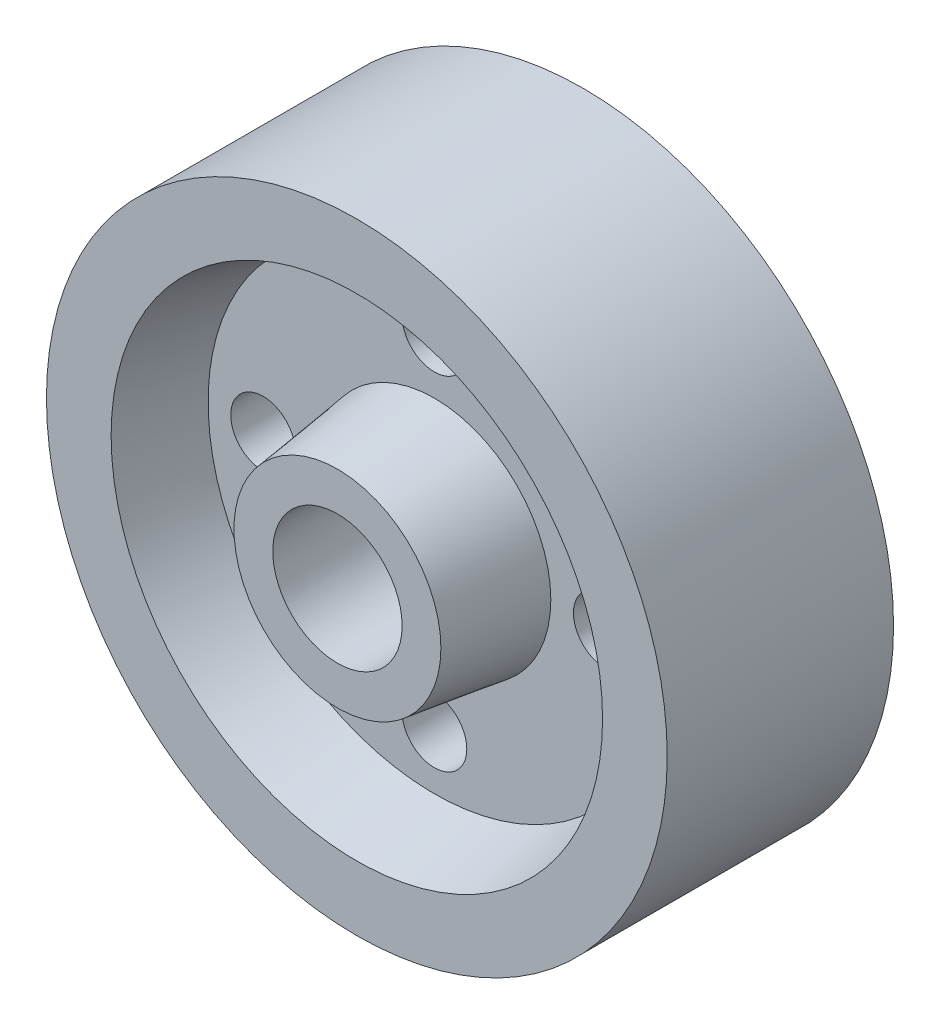
ISO-10303-21;
HEADER;
FILE_DESCRIPTION(('STEP AP214'),'2;1');
FILE_NAME('part.step','',(''),(''),'','','');
FILE_SCHEMA(('AUTOMOTIVE_DESIGN { 1 0 10303 214 1 1 1 1 }'));
ENDSEC;
DATA;
#1=APPLICATION_CONTEXT('core data for automotive mechanical design processes');
#2=APPLICATION_PROTOCOL_DEFINITION('international standard','automotive_design',2000,#1);
#3=PRODUCT_CONTEXT('',#1,'mechanical');
#4=PRODUCT('Part','Part','',(#3));
#5=PRODUCT_RELATED_PRODUCT_CATEGORY('part','',(#4));
#6=PRODUCT_DEFINITION_FORMATION('','',#4);
#7=PRODUCT_DEFINITION_CONTEXT('part definition',#1,'design');
#8=PRODUCT_DEFINITION('design','',#6,#7);
#9=PRODUCT_DEFINITION_SHAPE('','',#8);
#10=(LENGTH_UNIT() NAMED_UNIT(*) SI_UNIT(.MILLI.,.METRE.));
#11=(NAMED_UNIT(*) PLANE_ANGLE_UNIT() SI_UNIT($,.RADIAN.));
#12=(NAMED_UNIT(*) SI_UNIT($,.STERADIAN.) SOLID_ANGLE_UNIT());
#13=UNCERTAINTY_MEASURE_WITH_UNIT(LENGTH_MEASURE(1.E-05),#10,'distance_accuracy_value','');
#14=(GEOMETRIC_REPRESENTATION_CONTEXT(3) GLOBAL_UNCERTAINTY_ASSIGNED_CONTEXT((#13)) GLOBAL_UNIT_ASSIGNED_CONTEXT((#10,
#11,#12)) REPRESENTATION_CONTEXT('',''));
#15=CARTESIAN_POINT('',(0.,0.,0.));
#16=DIRECTION('',(0.,0.,1.));
#17=DIRECTION('',(1.,0.,0.));
#18=AXIS2_PLACEMENT_3D('',#15,#16,#17);
#19=CARTESIAN_POINT('',(0.,0.,20.5));
#20=DIRECTION('',(0.,0.,1.));
#21=DIRECTION('',(1.,0.,0.));
#22=AXIS2_PLACEMENT_3D('',#19,#20,#21);
#23=CYLINDRICAL_SURFACE('',#22,48.);
#24=CARTESIAN_POINT('',(0.,0.,-17.5));
#25=DIRECTION('',(0.,0.,1.));
#26=DIRECTION('',(1.,0.,0.));
#27=AXIS2_PLACEMENT_3D('',#24,#25,#26);
#28=CIRCLE('',#27,48.);
#29=CARTESIAN_POINT('',(48.,0.,-17.5));
#30=VERTEX_POINT('',#29);
#31=EDGE_CURVE('E90',#30,#30,#28,.T.);
#32=ORIENTED_EDGE('',*,*,#31,.T.);
#33=EDGE_LOOP('',(#32));
#34=FACE_BOUND('',#33,.T.);
#35=CARTESIAN_POINT('',(0.,0.,17.5));
#36=DIRECTION('',(0.,0.,1.));
#37=DIRECTION('',(1.,0.,0.));
#38=AXIS2_PLACEMENT_3D('',#35,#36,#37);
#39=CIRCLE('',#38,48.);
#40=CARTESIAN_POINT('',(48.,0.,17.5));
#41=VERTEX_POINT('',#40);
#42=EDGE_CURVE('E10',#41,#41,#39,.T.);
#43=ORIENTED_EDGE('',*,*,#42,.F.);
#44=EDGE_LOOP('',(#43));
#45=FACE_BOUND('',#44,.T.);
#46=ADVANCED_FACE('F39',(#34,#45),#23,.T.);
#47=CARTESIAN_POINT('',(0.,0.,17.5));
#48=DIRECTION('',(0.,0.,-1.));
#49=DIRECTION('',(-1.,0.,0.));
#50=AXIS2_PLACEMENT_3D('',#47,#48,#49);
#51=PLANE('',#50);
#52=CARTESIAN_POINT('',(0.,0.,17.5));
#53=DIRECTION('',(0.,0.,1.));
#54=DIRECTION('',(1.,0.,0.));
#55=AXIS2_PLACEMENT_3D('',#52,#53,#54);
#56=CIRCLE('',#55,38.);
#57=CARTESIAN_POINT('',(38.,0.,17.5));
#58=VERTEX_POINT('',#57);
#59=EDGE_CURVE('E46',#58,#58,#56,.T.);
#60=ORIENTED_EDGE('',*,*,#59,.F.);
#61=EDGE_LOOP('',(#60));
#62=FACE_BOUND('',#61,.T.);
#63=ORIENTED_EDGE('',*,*,#42,.T.);
#64=EDGE_LOOP('',(#63));
#65=FACE_BOUND('',#64,.T.);
#66=ADVANCED_FACE('F174',(#62,#65),#51,.F.);
#67=CARTESIAN_POINT('',(0.,0.,5.5));
#68=DIRECTION('',(0.,0.,1.));
#69=DIRECTION('',(1.,0.,0.));
#70=AXIS2_PLACEMENT_3D('',#67,#68,#69);
#71=CONICAL_SURFACE('',#70,35.,0.244978663126864);
#72=ORIENTED_EDGE('',*,*,#59,.T.);
#73=EDGE_LOOP('',(#72));
#74=FACE_BOUND('',#73,.T.);
#75=CARTESIAN_POINT('',(0.,0.,5.5));
#76=DIRECTION('',(0.,0.,1.));
#77=DIRECTION('',(1.,0.,0.));
#78=AXIS2_PLACEMENT_3D('',#75,#76,#77);
#79=CIRCLE('',#78,35.);
#80=CARTESIAN_POINT('',(35.,0.,5.5));
#81=VERTEX_POINT('',#80);
#82=EDGE_CURVE('E51',#81,#81,#79,.T.);
#83=ORIENTED_EDGE('',*,*,#82,.F.);
#84=EDGE_LOOP('',(#83));
#85=FACE_BOUND('',#84,.T.);
#86=ADVANCED_FACE('F179',(#74,#85),#71,.F.);
#87=CARTESIAN_POINT('',(0.,0.,5.5));
#88=DIRECTION('',(0.,0.,1.));
#89=DIRECTION('',(1.,0.,0.));
#90=AXIS2_PLACEMENT_3D('',#87,#88,#89);
#91=PLANE('',#90);
#92=CARTESIAN_POINT('',(0.,26.5,5.5));
#93=DIRECTION('',(0.,0.,1.));
#94=DIRECTION('',(1.,0.,0.));
#95=AXIS2_PLACEMENT_3D('',#92,#93,#94);
#96=CIRCLE('',#95,5.);
#97=CARTESIAN_POINT('',(5.,26.5,5.5));
#98=VERTEX_POINT('',#97);
#99=EDGE_CURVE('E94',#98,#98,#96,.T.);
#100=ORIENTED_EDGE('',*,*,#99,.F.);
#101=EDGE_LOOP('',(#100));
#102=FACE_BOUND('',#101,.T.);
#103=CARTESIAN_POINT('',(-26.5,0.,5.5));
#104=DIRECTION('',(0.,0.,1.));
#105=DIRECTION('',(1.,0.,0.));
#106=AXIS2_PLACEMENT_3D('',#103,#104,#105);
#107=CIRCLE('',#106,5.00000000000093);
#108=CARTESIAN_POINT('',(-21.4999999999991,0.,5.5));
#109=VERTEX_POINT('',#108);
#110=EDGE_CURVE('E98',#109,#109,#107,.T.);
#111=ORIENTED_EDGE('',*,*,#110,.F.);
#112=EDGE_LOOP('',(#111));
#113=FACE_BOUND('',#112,.T.);
#114=CARTESIAN_POINT('',(0.,-26.5,5.5));
#115=DIRECTION('',(0.,0.,1.));
#116=DIRECTION('',(1.,0.,0.));
#117=AXIS2_PLACEMENT_3D('',#114,#115,#116);
#118=CIRCLE('',#117,5.00000000000142);
#119=CARTESIAN_POINT('',(5.00000000000141,-26.5,5.5));
#120=VERTEX_POINT('',#119);
#121=EDGE_CURVE('E102',#120,#120,#118,.T.);
#122=ORIENTED_EDGE('',*,*,#121,.F.);
#123=EDGE_LOOP('',(#122));
#124=FACE_BOUND('',#123,.T.);
#125=CARTESIAN_POINT('',(26.5,0.,5.5));
#126=DIRECTION('',(0.,0.,1.));
#127=DIRECTION('',(1.,0.,0.));
#128=AXIS2_PLACEMENT_3D('',#125,#126,#127);
#129=CIRCLE('',#128,5.00000000000049);
#130=CARTESIAN_POINT('',(31.5000000000005,0.,5.5));
#131=VERTEX_POINT('',#130);
#132=EDGE_CURVE('E106',#131,#131,#129,.T.);
#133=ORIENTED_EDGE('',*,*,#132,.F.);
#134=EDGE_LOOP('',(#133));
#135=FACE_BOUND('',#134,.T.);
#136=ORIENTED_EDGE('',*,*,#82,.T.);
#137=EDGE_LOOP('',(#136));
#138=FACE_BOUND('',#137,.T.);
#139=CARTESIAN_POINT('',(0.,0.,5.5));
#140=DIRECTION('',(0.,0.,1.));
#141=DIRECTION('',(1.,0.,0.));
#142=AXIS2_PLACEMENT_3D('',#139,#140,#141);
#143=CIRCLE('',#142,18.);
#144=CARTESIAN_POINT('',(18.,0.,5.5));
#145=VERTEX_POINT('',#144);
#146=EDGE_CURVE('E56',#145,#145,#143,.T.);
#147=ORIENTED_EDGE('',*,*,#146,.F.);
#148=EDGE_LOOP('',(#147));
#149=FACE_BOUND('',#148,.T.);
#150=ADVANCED_FACE('F170',(#102,#113,#124,#135,#138,#149),#91,.T.);
#151=CARTESIAN_POINT('',(0.,0.,20.5));
#152=DIRECTION('',(0.,0.,-1.));
#153=DIRECTION('',(-1.,0.,0.));
#154=AXIS2_PLACEMENT_3D('',#151,#152,#153);
#155=CONICAL_SURFACE('',#154,16.,0.132551532296674);
#156=ORIENTED_EDGE('',*,*,#146,.T.);
#157=EDGE_LOOP('',(#156));
#158=FACE_BOUND('',#157,.T.);
#159=CARTESIAN_POINT('',(0.,0.,20.5));
#160=DIRECTION('',(0.,0.,1.));
#161=DIRECTION('',(1.,0.,0.));
#162=AXIS2_PLACEMENT_3D('',#159,#160,#161);
#163=CIRCLE('',#162,16.);
#164=CARTESIAN_POINT('',(16.,0.,20.5));
#165=VERTEX_POINT('',#164);
#166=EDGE_CURVE('E62',#165,#165,#163,.T.);
#167=ORIENTED_EDGE('',*,*,#166,.F.);
#168=EDGE_LOOP('',(#167));
#169=FACE_BOUND('',#168,.T.);
#170=ADVANCED_FACE('F164',(#158,#169),#155,.T.);
#171=CARTESIAN_POINT('',(0.,0.,20.5));
#172=DIRECTION('',(0.,0.,1.));
#173=DIRECTION('',(1.,0.,0.));
#174=AXIS2_PLACEMENT_3D('',#171,#172,#173);
#175=PLANE('',#174);
#176=ORIENTED_EDGE('',*,*,#166,.T.);
#177=EDGE_LOOP('',(#176));
#178=FACE_BOUND('',#177,.T.);
#179=CARTESIAN_POINT('',(0.,0.,20.5));
#180=DIRECTION('',(0.,0.,1.));
#181=DIRECTION('',(1.,0.,0.));
#182=AXIS2_PLACEMENT_3D('',#179,#180,#181);
#183=CIRCLE('',#182,10.);
#184=CARTESIAN_POINT('',(10.,0.,20.5));
#185=VERTEX_POINT('',#184);
#186=EDGE_CURVE('E66',#185,#185,#183,.T.);
#187=ORIENTED_EDGE('',*,*,#186,.F.);
#188=EDGE_LOOP('',(#187));
#189=FACE_BOUND('',#188,.T.);
#190=ADVANCED_FACE('F159',(#178,#189),#175,.T.);
#191=CARTESIAN_POINT('',(0.,0.,20.5));
#192=DIRECTION('',(0.,0.,1.));
#193=DIRECTION('',(1.,0.,0.));
#194=AXIS2_PLACEMENT_3D('',#191,#192,#193);
#195=CYLINDRICAL_SURFACE('',#194,10.);
#196=CARTESIAN_POINT('',(0.,0.,-20.5));
#197=DIRECTION('',(0.,0.,1.));
#198=DIRECTION('',(1.,0.,0.));
#199=AXIS2_PLACEMENT_3D('',#196,#197,#198);
#200=CIRCLE('',#199,10.);
#201=CARTESIAN_POINT('',(10.,0.,-20.5));
#202=VERTEX_POINT('',#201);
#203=EDGE_CURVE('E70',#202,#202,#200,.T.);
#204=ORIENTED_EDGE('',*,*,#203,.F.);
#205=EDGE_LOOP('',(#204));
#206=FACE_BOUND('',#205,.T.);
#207=ORIENTED_EDGE('',*,*,#186,.T.);
#208=EDGE_LOOP('',(#207));
#209=FACE_BOUND('',#208,.T.);
#210=ADVANCED_FACE('F153',(#206,#209),#195,.F.);
#211=CARTESIAN_POINT('',(0.,0.,-20.5));
#212=DIRECTION('',(0.,0.,1.));
#213=DIRECTION('',(1.,0.,0.));
#214=AXIS2_PLACEMENT_3D('',#211,#212,#213);
#215=PLANE('',#214);
#216=CARTESIAN_POINT('',(0.,0.,-20.5));
#217=DIRECTION('',(0.,0.,1.));
#218=DIRECTION('',(1.,0.,0.));
#219=AXIS2_PLACEMENT_3D('',#216,#217,#218);
#220=CIRCLE('',#219,16.);
#221=CARTESIAN_POINT('',(16.,0.,-20.5));
#222=VERTEX_POINT('',#221);
#223=EDGE_CURVE('E74',#222,#222,#220,.T.);
#224=ORIENTED_EDGE('',*,*,#223,.F.);
#225=EDGE_LOOP('',(#224));
#226=FACE_BOUND('',#225,.T.);
#227=ORIENTED_EDGE('',*,*,#203,.T.);
#228=EDGE_LOOP('',(#227));
#229=FACE_BOUND('',#228,.T.);
#230=ADVANCED_FACE('F147',(#226,#229),#215,.F.);
#231=CARTESIAN_POINT('',(0.,0.,-20.5));
#232=DIRECTION('',(0.,0.,1.));
#233=DIRECTION('',(1.,0.,0.));
#234=AXIS2_PLACEMENT_3D('',#231,#232,#233);
#235=CONICAL_SURFACE('',#234,16.,0.132551532296674);
#236=CARTESIAN_POINT('',(0.,0.,-5.5));
#237=DIRECTION('',(0.,0.,1.));
#238=DIRECTION('',(1.,0.,0.));
#239=AXIS2_PLACEMENT_3D('',#236,#237,#238);
#240=CIRCLE('',#239,18.);
#241=CARTESIAN_POINT('',(18.,0.,-5.5));
#242=VERTEX_POINT('',#241);
#243=EDGE_CURVE('E78',#242,#242,#240,.T.);
#244=ORIENTED_EDGE('',*,*,#243,.F.);
#245=EDGE_LOOP('',(#244));
#246=FACE_BOUND('',#245,.T.);
#247=ORIENTED_EDGE('',*,*,#223,.T.);
#248=EDGE_LOOP('',(#247));
#249=FACE_BOUND('',#248,.T.);
#250=ADVANCED_FACE('F133',(#246,#249),#235,.T.);
#251=CARTESIAN_POINT('',(0.,0.,-5.5));
#252=DIRECTION('',(0.,0.,1.));
#253=DIRECTION('',(1.,0.,0.));
#254=AXIS2_PLACEMENT_3D('',#251,#252,#253);
#255=PLANE('',#254);
#256=CARTESIAN_POINT('',(0.,26.5,-5.5));
#257=DIRECTION('',(0.,0.,-1.));
#258=DIRECTION('',(-1.,0.,0.));
#259=AXIS2_PLACEMENT_3D('',#256,#257,#258);
#260=CIRCLE('',#259,5.);
#261=CARTESIAN_POINT('',(-5.,26.5,-5.5));
#262=VERTEX_POINT('',#261);
#263=EDGE_CURVE('E110',#262,#262,#260,.T.);
#264=ORIENTED_EDGE('',*,*,#263,.F.);
#265=EDGE_LOOP('',(#264));
#266=FACE_BOUND('',#265,.T.);
#267=CARTESIAN_POINT('',(-26.5,0.,-5.5));
#268=DIRECTION('',(0.,0.,-1.));
#269=DIRECTION('',(-1.,0.,0.));
#270=AXIS2_PLACEMENT_3D('',#267,#268,#269);
#271=CIRCLE('',#270,5.00000000000093);
#272=CARTESIAN_POINT('',(-31.5000000000009,0.,-5.5));
#273=VERTEX_POINT('',#272);
#274=EDGE_CURVE('E119',#273,#273,#271,.T.);
#275=ORIENTED_EDGE('',*,*,#274,.F.);
#276=EDGE_LOOP('',(#275));
#277=FACE_BOUND('',#276,.T.);
#278=CARTESIAN_POINT('',(0.,-26.5,-5.5));
#279=DIRECTION('',(0.,0.,-1.));
#280=DIRECTION('',(-1.,0.,0.));
#281=AXIS2_PLACEMENT_3D('',#278,#279,#280);
#282=CIRCLE('',#281,5.00000000000142);
#283=CARTESIAN_POINT('',(-5.00000000000143,-26.5,-5.5));
#284=VERTEX_POINT('',#283);
#285=EDGE_CURVE('E115',#284,#284,#282,.T.);
#286=ORIENTED_EDGE('',*,*,#285,.F.);
#287=EDGE_LOOP('',(#286));
#288=FACE_BOUND('',#287,.T.);
#289=CARTESIAN_POINT('',(26.5,0.,-5.5));
#290=DIRECTION('',(0.,0.,-1.));
#291=DIRECTION('',(-1.,0.,0.));
#292=AXIS2_PLACEMENT_3D('',#289,#290,#291);
#293=CIRCLE('',#292,5.00000000000049);
#294=CARTESIAN_POINT('',(21.4999999999995,0.,-5.5));
#295=VERTEX_POINT('',#294);
#296=EDGE_CURVE('E111',#295,#295,#293,.T.);
#297=ORIENTED_EDGE('',*,*,#296,.F.);
#298=EDGE_LOOP('',(#297));
#299=FACE_BOUND('',#298,.T.);
#300=CARTESIAN_POINT('',(0.,0.,-5.5));
#301=DIRECTION('',(0.,0.,1.));
#302=DIRECTION('',(1.,0.,0.));
#303=AXIS2_PLACEMENT_3D('',#300,#301,#302);
#304=CIRCLE('',#303,35.);
#305=CARTESIAN_POINT('',(35.,0.,-5.5));
#306=VERTEX_POINT('',#305);
#307=EDGE_CURVE('E82',#306,#306,#304,.T.);
#308=ORIENTED_EDGE('',*,*,#307,.F.);
#309=EDGE_LOOP('',(#308));
#310=FACE_BOUND('',#309,.T.);
#311=ORIENTED_EDGE('',*,*,#243,.T.);
#312=EDGE_LOOP('',(#311));
#313=FACE_BOUND('',#312,.T.);
#314=ADVANCED_FACE('F129',(#266,#277,#288,#299,#310,#313),#255,.F.);
#315=CARTESIAN_POINT('',(0.,0.,-5.5));
#316=DIRECTION('',(0.,0.,-1.));
#317=DIRECTION('',(-1.,0.,0.));
#318=AXIS2_PLACEMENT_3D('',#315,#316,#317);
#319=CONICAL_SURFACE('',#318,35.,0.244978663126864);
#320=CARTESIAN_POINT('',(0.,0.,-17.5));
#321=DIRECTION('',(0.,0.,1.));
#322=DIRECTION('',(1.,0.,0.));
#323=AXIS2_PLACEMENT_3D('',#320,#321,#322);
#324=CIRCLE('',#323,38.);
#325=CARTESIAN_POINT('',(38.,0.,-17.5));
#326=VERTEX_POINT('',#325);
#327=EDGE_CURVE('E86',#326,#326,#324,.T.);
#328=ORIENTED_EDGE('',*,*,#327,.F.);
#329=EDGE_LOOP('',(#328));
#330=FACE_BOUND('',#329,.T.);
#331=ORIENTED_EDGE('',*,*,#307,.T.);
#332=EDGE_LOOP('',(#331));
#333=FACE_BOUND('',#332,.T.);
#334=ADVANCED_FACE('F132',(#330,#333),#319,.F.);
#335=CARTESIAN_POINT('',(0.,0.,-17.5));
#336=DIRECTION('',(0.,0.,-1.));
#337=DIRECTION('',(-1.,0.,0.));
#338=AXIS2_PLACEMENT_3D('',#335,#336,#337);
#339=PLANE('',#338);
#340=ORIENTED_EDGE('',*,*,#327,.T.);
#341=EDGE_LOOP('',(#340));
#342=FACE_BOUND('',#341,.T.);
#343=ORIENTED_EDGE('',*,*,#31,.F.);
#344=EDGE_LOOP('',(#343));
#345=FACE_BOUND('',#344,.T.);
#346=ADVANCED_FACE('F184',(#342,#345),#339,.T.);
#347=CARTESIAN_POINT('',(26.5,0.,20.5));
#348=DIRECTION('',(0.,0.,-1.));
#349=DIRECTION('',(-1.,0.,0.));
#350=AXIS2_PLACEMENT_3D('',#347,#348,#349);
#351=CYLINDRICAL_SURFACE('',#350,5.00000000000049);
#352=ORIENTED_EDGE('',*,*,#132,.T.);
#353=EDGE_LOOP('',(#352));
#354=FACE_BOUND('',#353,.T.);
#355=ORIENTED_EDGE('',*,*,#296,.T.);
#356=EDGE_LOOP('',(#355));
#357=FACE_BOUND('',#356,.T.);
#358=ADVANCED_FACE('F186',(#354,#357),#351,.F.);
#359=CARTESIAN_POINT('',(0.,-26.5,20.5));
#360=DIRECTION('',(0.,0.,-1.));
#361=DIRECTION('',(-1.,0.,0.));
#362=AXIS2_PLACEMENT_3D('',#359,#360,#361);
#363=CYLINDRICAL_SURFACE('',#362,5.00000000000142);
#364=ORIENTED_EDGE('',*,*,#121,.T.);
#365=EDGE_LOOP('',(#364));
#366=FACE_BOUND('',#365,.T.);
#367=ORIENTED_EDGE('',*,*,#285,.T.);
#368=EDGE_LOOP('',(#367));
#369=FACE_BOUND('',#368,.T.);
#370=ADVANCED_FACE('F193',(#366,#369),#363,.F.);
#371=CARTESIAN_POINT('',(-26.5,0.,20.5));
#372=DIRECTION('',(0.,0.,-1.));
#373=DIRECTION('',(-1.,0.,0.));
#374=AXIS2_PLACEMENT_3D('',#371,#372,#373);
#375=CYLINDRICAL_SURFACE('',#374,5.00000000000093);
#376=ORIENTED_EDGE('',*,*,#110,.T.);
#377=EDGE_LOOP('',(#376));
#378=FACE_BOUND('',#377,.T.);
#379=ORIENTED_EDGE('',*,*,#274,.T.);
#380=EDGE_LOOP('',(#379));
#381=FACE_BOUND('',#380,.T.);
#382=ADVANCED_FACE('F201',(#378,#381),#375,.F.);
#383=CARTESIAN_POINT('',(0.,26.5,20.5));
#384=DIRECTION('',(0.,0.,-1.));
#385=DIRECTION('',(-1.,0.,0.));
#386=AXIS2_PLACEMENT_3D('',#383,#384,#385);
#387=CYLINDRICAL_SURFACE('',#386,5.);
#388=ORIENTED_EDGE('',*,*,#99,.T.);
#389=EDGE_LOOP('',(#388));
#390=FACE_BOUND('',#389,.T.);
#391=ORIENTED_EDGE('',*,*,#263,.T.);
#392=EDGE_LOOP('',(#391));
#393=FACE_BOUND('',#392,.T.);
#394=ADVANCED_FACE('F127',(#390,#393),#387,.F.);
#395=CLOSED_SHELL('',(#46,#66,#86,#150,#170,#190,#210,#230,#250,#314,#334,#346,#358,#370,#382,#394));
#396=MANIFOLD_SOLID_BREP('B2',#395);
#397=ADVANCED_BREP_SHAPE_REPRESENTATION('',(#18,#396),#14);
#398=SHAPE_DEFINITION_REPRESENTATION(#9,#397);
ENDSEC;
END-ISO-10303-21;
